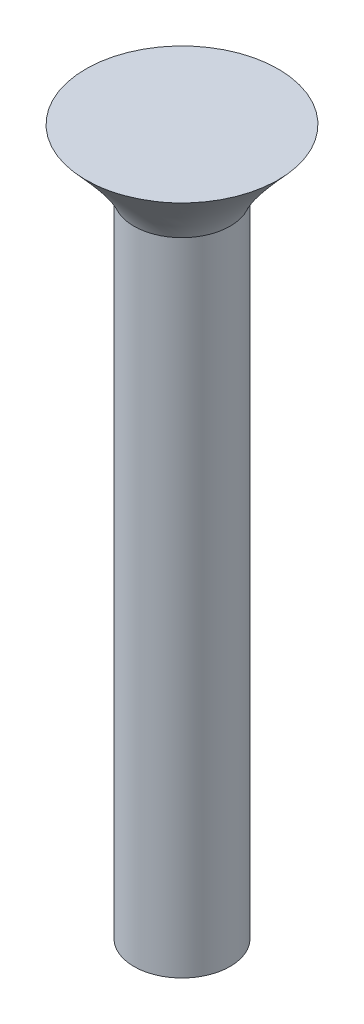
ISO-10303-21;
HEADER;
FILE_DESCRIPTION(('STEP AP214'),'2;1');
FILE_NAME('part.step','',(''),(''),'','','');
FILE_SCHEMA(('AUTOMOTIVE_DESIGN { 1 0 10303 214 1 1 1 1 }'));
ENDSEC;
DATA;
#1=APPLICATION_CONTEXT('core data for automotive mechanical design processes');
#2=APPLICATION_PROTOCOL_DEFINITION('international standard','automotive_design',2000,#1);
#3=PRODUCT_CONTEXT('',#1,'mechanical');
#4=PRODUCT('Part','Part','',(#3));
#5=PRODUCT_RELATED_PRODUCT_CATEGORY('part','',(#4));
#6=PRODUCT_DEFINITION_FORMATION('','',#4);
#7=PRODUCT_DEFINITION_CONTEXT('part definition',#1,'design');
#8=PRODUCT_DEFINITION('design','',#6,#7);
#9=PRODUCT_DEFINITION_SHAPE('','',#8);
#10=(LENGTH_UNIT() NAMED_UNIT(*) SI_UNIT(.MILLI.,.METRE.));
#11=(NAMED_UNIT(*) PLANE_ANGLE_UNIT() SI_UNIT($,.RADIAN.));
#12=(NAMED_UNIT(*) SI_UNIT($,.STERADIAN.) SOLID_ANGLE_UNIT());
#13=UNCERTAINTY_MEASURE_WITH_UNIT(LENGTH_MEASURE(1.E-05),#10,'distance_accuracy_value','');
#14=(GEOMETRIC_REPRESENTATION_CONTEXT(3) GLOBAL_UNCERTAINTY_ASSIGNED_CONTEXT((#13)) GLOBAL_UNIT_ASSIGNED_CONTEXT((#10,
#11,#12)) REPRESENTATION_CONTEXT('',''));
#15=CARTESIAN_POINT('',(0.,0.,0.));
#16=DIRECTION('',(0.,0.,1.));
#17=DIRECTION('',(1.,0.,0.));
#18=AXIS2_PLACEMENT_3D('',#15,#16,#17);
#19=CARTESIAN_POINT('',(0.,20.,0.));
#20=DIRECTION('',(0.,-1.,0.));
#21=DIRECTION('',(0.,0.,-1.));
#22=AXIS2_PLACEMENT_3D('',#19,#20,#21);
#23=CYLINDRICAL_SURFACE('',#22,1.5);
#24=CARTESIAN_POINT('',(0.,20.,0.));
#25=DIRECTION('',(0.,-1.,0.));
#26=DIRECTION('',(0.,0.,-1.));
#27=AXIS2_PLACEMENT_3D('',#24,#25,#26);
#28=CIRCLE('',#27,1.5);
#29=CARTESIAN_POINT('',(-1.36710491495317,20.,-0.617271537907664));
#30=VERTEX_POINT('',#29);
#31=EDGE_CURVE('E11',#30,#30,#28,.F.);
#32=ORIENTED_EDGE('',*,*,#31,.F.);
#33=EDGE_LOOP('',(#32));
#34=FACE_BOUND('',#33,.T.);
#35=CARTESIAN_POINT('',(0.,0.,0.));
#36=DIRECTION('',(0.,1.,0.));
#37=DIRECTION('',(0.,0.,1.));
#38=AXIS2_PLACEMENT_3D('',#35,#36,#37);
#39=CIRCLE('',#38,1.5);
#40=CARTESIAN_POINT('',(0.,0.,1.5));
#41=VERTEX_POINT('',#40);
#42=EDGE_CURVE('E45',#41,#41,#39,.T.);
#43=ORIENTED_EDGE('',*,*,#42,.T.);
#44=EDGE_LOOP('',(#43));
#45=FACE_BOUND('',#44,.T.);
#46=ADVANCED_FACE('F38',(#34,#45),#23,.T.);
#47=CARTESIAN_POINT('',(0.,0.,0.));
#48=DIRECTION('',(0.,1.,0.));
#49=DIRECTION('',(0.,0.,1.));
#50=AXIS2_PLACEMENT_3D('',#47,#48,#49);
#51=PLANE('',#50);
#52=ORIENTED_EDGE('',*,*,#42,.F.);
#53=EDGE_LOOP('',(#52));
#54=FACE_BOUND('',#53,.T.);
#55=ADVANCED_FACE('F71',(#54),#51,.F.);
#56=CARTESIAN_POINT('',(0.,22.000000064,0.));
#57=DIRECTION('',(0.,1.,0.));
#58=DIRECTION('',(0.,0.,1.));
#59=AXIS2_PLACEMENT_3D('',#56,#57,#58);
#60=PLANE('',#59);
#61=CARTESIAN_POINT('',(0.,22.000000064,0.));
#62=DIRECTION('',(0.,1.,0.));
#63=DIRECTION('',(0.,0.,1.));
#64=AXIS2_PLACEMENT_3D('',#61,#62,#63);
#65=CIRCLE('',#64,3.);
#66=CARTESIAN_POINT('',(-1.35188479839082,22.000000064,-2.67813507722815));
#67=VERTEX_POINT('',#66);
#68=EDGE_CURVE('E49',#67,#67,#65,.T.);
#69=ORIENTED_EDGE('',*,*,#68,.T.);
#70=EDGE_LOOP('',(#69));
#71=FACE_BOUND('',#70,.T.);
#72=ADVANCED_FACE('F61',(#71),#60,.T.);
#73=CARTESIAN_POINT('',(-1.36710491495317,20.,-0.617271537907664));
#74=CARTESIAN_POINT('',(-1.35188479839082,22.000000064,-2.67813507722815));
#75=CARTESIAN_POINT('',(-2.6016479907685,20.,2.11693829199867));
#76=CARTESIAN_POINT('',(-6.70815495284712,22.000000064,0.0256345195534906));
#77=CARTESIAN_POINT('',(0.132561839137841,20.,3.351481367814));
#78=CARTESIAN_POINT('',(-4.00438535606548,22.000000064,5.38190467400979));
#79=CARTESIAN_POINT('',(1.36710491495317,20.,0.617271537907664));
#80=CARTESIAN_POINT('',(1.35188479839082,22.000000064,2.67813507722815));
#81=CARTESIAN_POINT('',(2.6016479907685,20.,-2.11693829199867));
#82=CARTESIAN_POINT('',(6.70815495284711,22.000000064,-0.0256345195534927));
#83=CARTESIAN_POINT('',(-0.13256183913784,20.,-3.351481367814));
#84=CARTESIAN_POINT('',(4.00438535606547,22.000000064,-5.38190467400979));
#85=CARTESIAN_POINT('',(-1.36710491495317,20.,-0.617271537907664));
#86=CARTESIAN_POINT('',(-1.35188479839082,22.000000064,-2.67813507722815));
#87=(BOUNDED_SURFACE() B_SPLINE_SURFACE(3,1,((#73,#74),(#75,#76),(#77,#78),(#79,#80),(#81,#82),
(#83,#84),(#85,#86)),.UNSPECIFIED.,.T.,.F.,.F.) B_SPLINE_SURFACE_WITH_KNOTS((4,3,4),(2,2),(0.,
0.5,1.),(0.,1.),.UNSPECIFIED.) GEOMETRIC_REPRESENTATION_ITEM() RATIONAL_B_SPLINE_SURFACE(((1.,
1.),(0.333333333333333,0.333333333333333),(0.333333333333333,0.333333333333333),(1.,1.),
(0.333333333333333,0.333333333333333),(0.333333333333333,0.333333333333333),(1.,1.))) REPRESENTATION_ITEM('') SURFACE());
#88=CARTESIAN_POINT('',(-1.36710491495317,20.,-0.617271537907664));
#89=CARTESIAN_POINT('',(-1.36694637207231,20.020833334,-0.638738866442251));
#90=CARTESIAN_POINT('',(-1.36678782919145,20.041666668,-0.66020619497684));
#91=CARTESIAN_POINT('',(-1.36647074342974,20.083333336,-0.703140852046017));
#92=CARTESIAN_POINT('',(-1.36631220054888,20.10416667,-0.724608180580606));
#93=CARTESIAN_POINT('',(-1.36599511478716,20.145833338,-0.767542837649783));
#94=CARTESIAN_POINT('',(-1.36583657190631,20.166666672,-0.789010166184371));
#95=CARTESIAN_POINT('',(-1.36551948614459,20.20833334,-0.831944823253547));
#96=CARTESIAN_POINT('',(-1.36536094326373,20.229166674,-0.853412151788136));
#97=CARTESIAN_POINT('',(-1.36504385750202,20.270833342,-0.896346808857313));
#98=CARTESIAN_POINT('',(-1.36488531462116,20.291666676,-0.917814137391901));
#99=CARTESIAN_POINT('',(-1.36456822885944,20.333333344,-0.960748794461078));
#100=CARTESIAN_POINT('',(-1.36440968597859,20.354166678,-0.982216122995666));
#101=CARTESIAN_POINT('',(-1.36409260021687,20.395833346,-1.02515078006484));
#102=CARTESIAN_POINT('',(-1.36393405733601,20.41666668,-1.04661810859943));
#103=CARTESIAN_POINT('',(-1.3636169715743,20.458333348,-1.08955276566861));
#104=CARTESIAN_POINT('',(-1.36345842869344,20.479166682,-1.1110200942032));
#105=CARTESIAN_POINT('',(-1.36314134293172,20.52083335,-1.15395475127237));
#106=CARTESIAN_POINT('',(-1.36298280005087,20.541666684,-1.17542207980696));
#107=CARTESIAN_POINT('',(-1.36266571428915,20.583333352,-1.21835673687614));
#108=CARTESIAN_POINT('',(-1.36250717140829,20.604166686,-1.23982406541073));
#109=CARTESIAN_POINT('',(-1.36219008564658,20.645833354,-1.2827587224799));
#110=CARTESIAN_POINT('',(-1.36203154276572,20.666666688,-1.30422605101449));
#111=CARTESIAN_POINT('',(-1.361714457004,20.708333356,-1.34716070808367));
#112=CARTESIAN_POINT('',(-1.36155591412314,20.72916669,-1.36862803661826));
#113=CARTESIAN_POINT('',(-1.36123882836143,20.770833358,-1.41156269368743));
#114=CARTESIAN_POINT('',(-1.36108028548057,20.791666692,-1.43303002222202));
#115=CARTESIAN_POINT('',(-1.36076319971886,20.83333336,-1.4759646792912));
#116=CARTESIAN_POINT('',(-1.360604656838,20.854166694,-1.49743200782579));
#117=CARTESIAN_POINT('',(-1.36028757107628,20.895833362,-1.54036666489496));
#118=CARTESIAN_POINT('',(-1.36012902819542,20.916666696,-1.56183399342955));
#119=CARTESIAN_POINT('',(-1.35981194243371,20.958333364,-1.60476865049873));
#120=CARTESIAN_POINT('',(-1.35965339955285,20.979166698,-1.62623597903332));
#121=CARTESIAN_POINT('',(-1.35933631379114,21.020833366,-1.66917063610249));
#122=CARTESIAN_POINT('',(-1.35917777091028,21.0416667,-1.69063796463708));
#123=CARTESIAN_POINT('',(-1.35886068514856,21.083333368,-1.73357262170626));
#124=CARTESIAN_POINT('',(-1.3587021422677,21.104166702,-1.75503995024085));
#125=CARTESIAN_POINT('',(-1.35838505650599,21.14583337,-1.79797460731003));
#126=CARTESIAN_POINT('',(-1.35822651362513,21.166666704,-1.81944193584461));
#127=CARTESIAN_POINT('',(-1.35790942786342,21.208333372,-1.86237659291379));
#128=CARTESIAN_POINT('',(-1.35775088498256,21.229166706,-1.88384392144838));
#129=CARTESIAN_POINT('',(-1.35743379922084,21.270833374,-1.92677857851756));
#130=CARTESIAN_POINT('',(-1.35727525633998,21.291666708,-1.94824590705214));
#131=CARTESIAN_POINT('',(-1.35695817057827,21.333333376,-1.99118056412132));
#132=CARTESIAN_POINT('',(-1.35679962769741,21.35416671,-2.01264789265591));
#133=CARTESIAN_POINT('',(-1.3564825419357,21.395833378,-2.05558254972509));
#134=CARTESIAN_POINT('',(-1.35632399905484,21.416666712,-2.07704987825967));
#135=CARTESIAN_POINT('',(-1.35600691329312,21.45833338,-2.11998453532885));
#136=CARTESIAN_POINT('',(-1.35584837041226,21.479166714,-2.14145186386344));
#137=CARTESIAN_POINT('',(-1.35553128465055,21.520833382,-2.18438652093262));
#138=CARTESIAN_POINT('',(-1.35537274176969,21.541666716,-2.2058538494672));
#139=CARTESIAN_POINT('',(-1.35505565600797,21.583333384,-2.24878850653638));
#140=CARTESIAN_POINT('',(-1.35489711312712,21.604166718,-2.27025583507097));
#141=CARTESIAN_POINT('',(-1.3545800273654,21.645833386,-2.31319049214015));
#142=CARTESIAN_POINT('',(-1.35442148448454,21.66666672,-2.33465782067473));
#143=CARTESIAN_POINT('',(-1.35410439872283,21.708333388,-2.37759247774391));
#144=CARTESIAN_POINT('',(-1.35394585584197,21.729166722,-2.3990598062785));
#145=CARTESIAN_POINT('',(-1.35362877008025,21.77083339,-2.44199446334768));
#146=CARTESIAN_POINT('',(-1.3534702271994,21.791666724,-2.46346179188227));
#147=CARTESIAN_POINT('',(-1.35315314143768,21.833333392,-2.50639644895144));
#148=CARTESIAN_POINT('',(-1.35299459855682,21.854166726,-2.52786377748603));
#149=CARTESIAN_POINT('',(-1.35267751279511,21.895833394,-2.57079843455521));
#150=CARTESIAN_POINT('',(-1.35251896991425,21.916666728,-2.59226576308979));
#151=CARTESIAN_POINT('',(-1.35220188415253,21.958333396,-2.63520042015897));
#152=CARTESIAN_POINT('',(-1.35204334127168,21.97916673,-2.65666774869356));
#153=CARTESIAN_POINT('',(-1.35188479839082,22.000000064,-2.67813507722815));
#154=B_SPLINE_CURVE_WITH_KNOTS('',3,(#88,#89,#90,#91,#92,#93,#94,#95,#96,#97,#98,#99,#100,#101,
#102,#103,#104,#105,#106,#107,#108,#109,#110,#111,#112,#113,#114,#115,#116,#117,#118,#119,#120,
#121,#122,#123,#124,#125,#126,#127,#128,#129,#130,#131,#132,#133,#134,#135,#136,#137,#138,#139,
#140,#141,#142,#143,#144,#145,#146,#147,#148,#149,#150,#151,#152,#153),.UNSPECIFIED.,.F.,.F.,(4,
2,2,2,2,2,2,2,2,2,2,2,2,2,2,2,2,2,2,2,2,2,2,2,2,2,2,2,2,2,2,2,4),(0.,0.0897445943904886,
0.179489188780975,0.269233783171463,0.358978377561952,0.448722971952441,0.538467566342929,
0.628212160733416,0.717956755123904,0.807701349514393,0.897445943904879,0.987190538295368,
1.07693513268586,1.16667972707634,1.25642432146683,1.34616891585732,1.43591351024781,
1.5256581046383,1.61540269902878,1.70514729341927,1.79489188780976,1.88463648220025,
1.97438107659074,2.06412567098122,2.15387026537171,2.2436148597622,2.33335945415269,
2.42310404854318,2.51284864293367,2.60259323732415,2.69233783171464,2.78208242610513,
2.87182702049562),.UNSPECIFIED.);
#155=EDGE_CURVE('BSEAM70',#30,#67,#154,.T.);
#156=ORIENTED_EDGE('',*,*,#31,.T.);
#157=ORIENTED_EDGE('',*,*,#68,.F.);
#158=ORIENTED_EDGE('',*,*,#155,.T.);
#159=ORIENTED_EDGE('',*,*,#155,.F.);
#160=EDGE_LOOP('',(#156,#158,#157,#159));
#161=FACE_BOUND('',#160,.T.);
#162=ADVANCED_FACE('F70',(#161),#87,.T.);
#163=CLOSED_SHELL('',(#46,#55,#72,#162));
#164=MANIFOLD_SOLID_BREP('B2',#163);
#165=ADVANCED_BREP_SHAPE_REPRESENTATION('',(#18,#164),#14);
#166=SHAPE_DEFINITION_REPRESENTATION(#9,#165);
ENDSEC;
END-ISO-10303-21;
